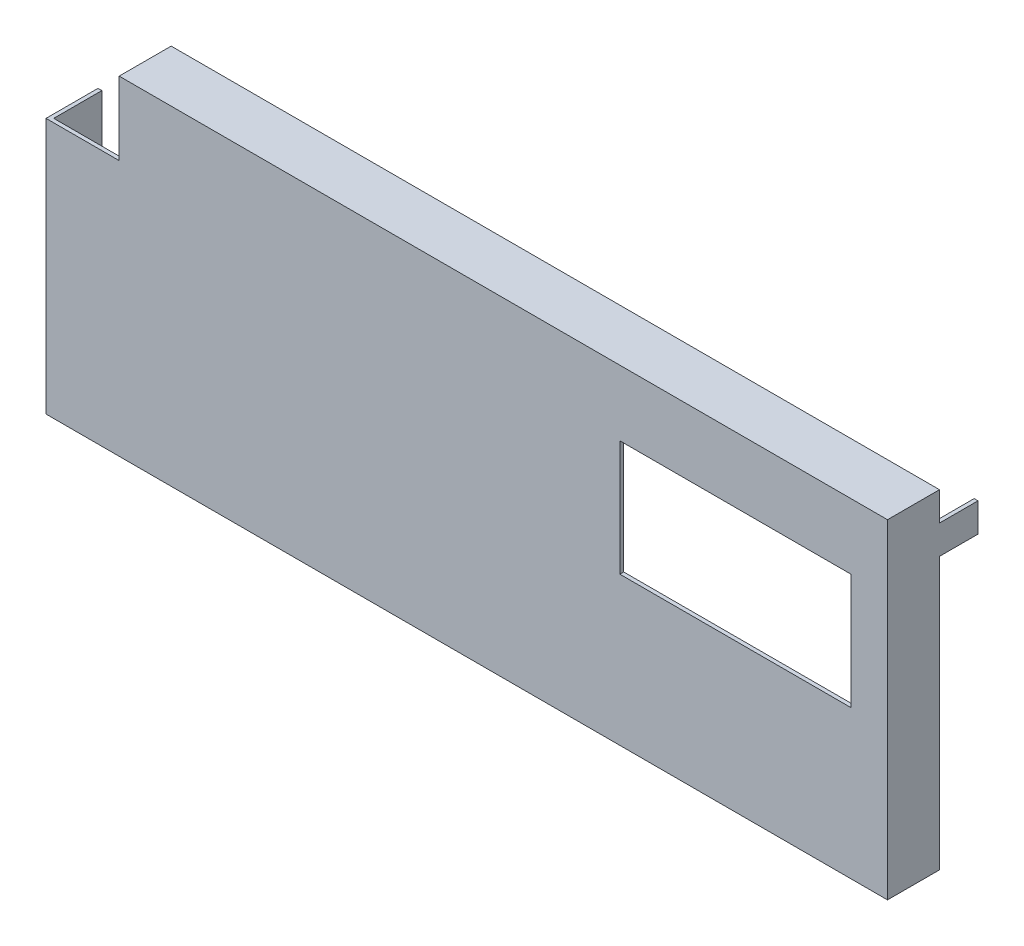
ISO-10303-21;
HEADER;
FILE_DESCRIPTION(('STEP AP214'),'2;1');
FILE_NAME('part.step','',(''),(''),'','','');
FILE_SCHEMA(('AUTOMOTIVE_DESIGN { 1 0 10303 214 1 1 1 1 }'));
ENDSEC;
DATA;
#1=APPLICATION_CONTEXT('core data for automotive mechanical design processes');
#2=APPLICATION_PROTOCOL_DEFINITION('international standard','automotive_design',2000,#1);
#3=PRODUCT_CONTEXT('',#1,'mechanical');
#4=PRODUCT('Part','Part','',(#3));
#5=PRODUCT_RELATED_PRODUCT_CATEGORY('part','',(#4));
#6=PRODUCT_DEFINITION_FORMATION('','',#4);
#7=PRODUCT_DEFINITION_CONTEXT('part definition',#1,'design');
#8=PRODUCT_DEFINITION('design','',#6,#7);
#9=PRODUCT_DEFINITION_SHAPE('','',#8);
#10=(LENGTH_UNIT() NAMED_UNIT(*) SI_UNIT(.MILLI.,.METRE.));
#11=(NAMED_UNIT(*) PLANE_ANGLE_UNIT() SI_UNIT($,.RADIAN.));
#12=(NAMED_UNIT(*) SI_UNIT($,.STERADIAN.) SOLID_ANGLE_UNIT());
#13=UNCERTAINTY_MEASURE_WITH_UNIT(LENGTH_MEASURE(1.E-05),#10,'distance_accuracy_value','');
#14=(GEOMETRIC_REPRESENTATION_CONTEXT(3) GLOBAL_UNCERTAINTY_ASSIGNED_CONTEXT((#13)) GLOBAL_UNIT_ASSIGNED_CONTEXT((#10,
#11,#12)) REPRESENTATION_CONTEXT('',''));
#15=CARTESIAN_POINT('',(0.,0.,0.));
#16=DIRECTION('',(0.,0.,1.));
#17=DIRECTION('',(1.,0.,0.));
#18=AXIS2_PLACEMENT_3D('',#15,#16,#17);
#19=CARTESIAN_POINT('',(-21.85,-8.35,0.));
#20=DIRECTION('',(0.,-1.,0.));
#21=DIRECTION('',(0.,0.,-1.));
#22=AXIS2_PLACEMENT_3D('',#19,#20,#21);
#23=PLANE('',#22);
#24=DIRECTION('',(1.,0.,0.));
#25=VECTOR('',#24,1.);
#26=CARTESIAN_POINT('',(0.,-8.35,2.5));
#27=LINE('',#26,#25);
#28=CARTESIAN_POINT('',(-21.65,-8.35,2.5));
#29=VERTEX_POINT('',#28);
#30=CARTESIAN_POINT('',(21.65,-8.35,2.5));
#31=VERTEX_POINT('',#30);
#32=EDGE_CURVE('E274',#29,#31,#27,.T.);
#33=ORIENTED_EDGE('',*,*,#32,.T.);
#34=DIRECTION('',(0.,0.,-1.));
#35=VECTOR('',#34,1.);
#36=CARTESIAN_POINT('',(21.65,-8.35,0.));
#37=LINE('',#36,#35);
#38=CARTESIAN_POINT('',(21.65,-8.35,0.));
#39=VERTEX_POINT('',#38);
#40=EDGE_CURVE('E19',#31,#39,#37,.T.);
#41=ORIENTED_EDGE('',*,*,#40,.T.);
#42=DIRECTION('',(1.,0.,0.));
#43=VECTOR('',#42,1.);
#44=CARTESIAN_POINT('',(0.,-8.35,0.));
#45=LINE('',#44,#43);
#46=CARTESIAN_POINT('',(-18.85,-8.35,0.));
#47=VERTEX_POINT('',#46);
#48=EDGE_CURVE('E309',#39,#47,#45,.F.);
#49=ORIENTED_EDGE('',*,*,#48,.T.);
#50=DIRECTION('',(0.,0.,-1.));
#51=VECTOR('',#50,1.);
#52=CARTESIAN_POINT('',(-18.85,-8.35,0.));
#53=LINE('',#52,#51);
#54=CARTESIAN_POINT('',(-18.85,-8.35,-2.));
#55=VERTEX_POINT('',#54);
#56=EDGE_CURVE('E317',#55,#47,#53,.F.);
#57=ORIENTED_EDGE('',*,*,#56,.F.);
#58=DIRECTION('',(-1.,0.,0.));
#59=VECTOR('',#58,1.);
#60=CARTESIAN_POINT('',(0.,-8.35,-2.));
#61=LINE('',#60,#59);
#62=CARTESIAN_POINT('',(-20.35,-8.35,-2.));
#63=VERTEX_POINT('',#62);
#64=EDGE_CURVE('E169',#63,#55,#61,.F.);
#65=ORIENTED_EDGE('',*,*,#64,.F.);
#66=DIRECTION('',(0.,0.,1.));
#67=VECTOR('',#66,1.);
#68=CARTESIAN_POINT('',(-20.35,-8.35,0.));
#69=LINE('',#68,#67);
#70=CARTESIAN_POINT('',(-20.35,-8.35,0.));
#71=VERTEX_POINT('',#70);
#72=EDGE_CURVE('E171',#71,#63,#69,.F.);
#73=ORIENTED_EDGE('',*,*,#72,.F.);
#74=DIRECTION('',(1.,0.,0.));
#75=VECTOR('',#74,1.);
#76=CARTESIAN_POINT('',(0.,-8.35,0.));
#77=LINE('',#76,#75);
#78=CARTESIAN_POINT('',(-21.65,-8.35,0.));
#79=VERTEX_POINT('',#78);
#80=EDGE_CURVE('E173',#71,#79,#77,.F.);
#81=ORIENTED_EDGE('',*,*,#80,.T.);
#82=DIRECTION('',(0.,0.,1.));
#83=VECTOR('',#82,1.);
#84=CARTESIAN_POINT('',(-21.65,-8.35,0.));
#85=LINE('',#84,#83);
#86=EDGE_CURVE('E279',#79,#29,#85,.T.);
#87=ORIENTED_EDGE('',*,*,#86,.T.);
#88=EDGE_LOOP('',(#33,#41,#49,#57,#65,#73,#81,#87));
#89=FACE_BOUND('',#88,.T.);
#90=ADVANCED_FACE('F16',(#89),#23,.F.);
#91=CARTESIAN_POINT('',(21.65,-8.55,0.));
#92=DIRECTION('',(1.,0.,0.));
#93=DIRECTION('',(0.,0.,-1.));
#94=AXIS2_PLACEMENT_3D('',#91,#92,#93);
#95=PLANE('',#94);
#96=DIRECTION('',(0.,1.,0.));
#97=VECTOR('',#96,1.);
#98=CARTESIAN_POINT('',(21.65,0.,2.5));
#99=LINE('',#98,#97);
#100=CARTESIAN_POINT('',(21.65,8.35,2.5));
#101=VERTEX_POINT('',#100);
#102=EDGE_CURVE('E272',#31,#101,#99,.T.);
#103=ORIENTED_EDGE('',*,*,#102,.T.);
#104=DIRECTION('',(0.,0.,1.));
#105=VECTOR('',#104,1.);
#106=CARTESIAN_POINT('',(21.65,8.35,0.));
#107=LINE('',#106,#105);
#108=CARTESIAN_POINT('',(21.65,8.35,0.));
#109=VERTEX_POINT('',#108);
#110=EDGE_CURVE('E285',#101,#109,#107,.F.);
#111=ORIENTED_EDGE('',*,*,#110,.T.);
#112=DIRECTION('',(0.,1.,0.));
#113=VECTOR('',#112,1.);
#114=CARTESIAN_POINT('',(21.65,0.,0.));
#115=LINE('',#114,#113);
#116=CARTESIAN_POINT('',(21.65,7.05,0.));
#117=VERTEX_POINT('',#116);
#118=EDGE_CURVE('E287',#109,#117,#115,.F.);
#119=ORIENTED_EDGE('',*,*,#118,.T.);
#120=DIRECTION('',(0.,0.,1.));
#121=VECTOR('',#120,1.);
#122=CARTESIAN_POINT('',(21.65,7.05,0.));
#123=LINE('',#122,#121);
#124=CARTESIAN_POINT('',(21.65,7.05,-2.));
#125=VERTEX_POINT('',#124);
#126=EDGE_CURVE('E294',#125,#117,#123,.T.);
#127=ORIENTED_EDGE('',*,*,#126,.F.);
#128=DIRECTION('',(0.,1.,0.));
#129=VECTOR('',#128,1.);
#130=CARTESIAN_POINT('',(21.65,0.,-2.));
#131=LINE('',#130,#129);
#132=CARTESIAN_POINT('',(21.65,5.55,-2.));
#133=VERTEX_POINT('',#132);
#134=EDGE_CURVE('E299',#133,#125,#131,.T.);
#135=ORIENTED_EDGE('',*,*,#134,.F.);
#136=DIRECTION('',(0.,0.,-1.));
#137=VECTOR('',#136,1.);
#138=CARTESIAN_POINT('',(21.65,5.55,0.));
#139=LINE('',#138,#137);
#140=CARTESIAN_POINT('',(21.65,5.55,0.));
#141=VERTEX_POINT('',#140);
#142=EDGE_CURVE('E307',#141,#133,#139,.T.);
#143=ORIENTED_EDGE('',*,*,#142,.F.);
#144=DIRECTION('',(0.,1.,0.));
#145=VECTOR('',#144,1.);
#146=CARTESIAN_POINT('',(21.65,0.,0.));
#147=LINE('',#146,#145);
#148=EDGE_CURVE('E312',#141,#39,#147,.F.);
#149=ORIENTED_EDGE('',*,*,#148,.T.);
#150=ORIENTED_EDGE('',*,*,#40,.F.);
#151=EDGE_LOOP('',(#103,#111,#119,#127,#135,#143,#149,#150));
#152=FACE_BOUND('',#151,.T.);
#153=ADVANCED_FACE('F403',(#152),#95,.F.);
#154=CARTESIAN_POINT('',(0.,0.,0.));
#155=DIRECTION('',(0.,0.,1.));
#156=DIRECTION('',(1.,0.,0.));
#157=AXIS2_PLACEMENT_3D('',#154,#155,#156);
#158=PLANE('',#157);
#159=DIRECTION('',(0.,1.,0.));
#160=VECTOR('',#159,1.);
#161=CARTESIAN_POINT('',(-21.85,8.55,0.));
#162=LINE('',#161,#160);
#163=CARTESIAN_POINT('',(-21.85,4.75,0.));
#164=VERTEX_POINT('',#163);
#165=CARTESIAN_POINT('',(-21.85,-8.55,0.));
#166=VERTEX_POINT('',#165);
#167=EDGE_CURVE('E210',#164,#166,#162,.F.);
#168=ORIENTED_EDGE('',*,*,#167,.F.);
#169=DIRECTION('',(1.,0.,0.));
#170=VECTOR('',#169,1.);
#171=CARTESIAN_POINT('',(0.,4.75,0.));
#172=LINE('',#171,#170);
#173=CARTESIAN_POINT('',(-21.65,4.75,0.));
#174=VERTEX_POINT('',#173);
#175=EDGE_CURVE('E189',#174,#164,#172,.F.);
#176=ORIENTED_EDGE('',*,*,#175,.F.);
#177=DIRECTION('',(0.,1.,0.));
#178=VECTOR('',#177,1.);
#179=CARTESIAN_POINT('',(-21.65,8.55,0.));
#180=LINE('',#179,#178);
#181=EDGE_CURVE('E187',#174,#79,#180,.F.);
#182=ORIENTED_EDGE('',*,*,#181,.T.);
#183=ORIENTED_EDGE('',*,*,#80,.F.);
#184=DIRECTION('',(0.,1.,0.));
#185=VECTOR('',#184,1.);
#186=CARTESIAN_POINT('',(-20.35,-8.55,0.));
#187=LINE('',#186,#185);
#188=CARTESIAN_POINT('',(-20.35,-8.55,0.));
#189=VERTEX_POINT('',#188);
#190=EDGE_CURVE('E178',#189,#71,#187,.T.);
#191=ORIENTED_EDGE('',*,*,#190,.F.);
#192=DIRECTION('',(1.,0.,0.));
#193=VECTOR('',#192,1.);
#194=CARTESIAN_POINT('',(0.,-8.55,0.));
#195=LINE('',#194,#193);
#196=EDGE_CURVE('E179',#166,#189,#195,.T.);
#197=ORIENTED_EDGE('',*,*,#196,.F.);
#198=EDGE_LOOP('',(#168,#176,#182,#183,#191,#197));
#199=FACE_BOUND('',#198,.T.);
#200=ADVANCED_FACE('F184',(#199),#158,.F.);
#201=CARTESIAN_POINT('',(-20.35,-8.55,0.));
#202=DIRECTION('',(-1.,0.,0.));
#203=DIRECTION('',(0.,0.,1.));
#204=AXIS2_PLACEMENT_3D('',#201,#202,#203);
#205=PLANE('',#204);
#206=DIRECTION('',(0.,0.,-1.));
#207=VECTOR('',#206,1.);
#208=CARTESIAN_POINT('',(-20.35,-8.55,0.));
#209=LINE('',#208,#207);
#210=CARTESIAN_POINT('',(-20.35,-8.55,-2.));
#211=VERTEX_POINT('',#210);
#212=EDGE_CURVE('E192',#189,#211,#209,.T.);
#213=ORIENTED_EDGE('',*,*,#212,.F.);
#214=ORIENTED_EDGE('',*,*,#190,.T.);
#215=ORIENTED_EDGE('',*,*,#72,.T.);
#216=DIRECTION('',(0.,1.,0.));
#217=VECTOR('',#216,1.);
#218=CARTESIAN_POINT('',(-20.35,0.,-2.));
#219=LINE('',#218,#217);
#220=EDGE_CURVE('E194',#211,#63,#219,.T.);
#221=ORIENTED_EDGE('',*,*,#220,.F.);
#222=EDGE_LOOP('',(#213,#214,#215,#221));
#223=FACE_BOUND('',#222,.T.);
#224=ADVANCED_FACE('F190',(#223),#205,.T.);
#225=CARTESIAN_POINT('',(0.,0.,-2.));
#226=DIRECTION('',(0.,0.,-1.));
#227=DIRECTION('',(-1.,0.,0.));
#228=AXIS2_PLACEMENT_3D('',#225,#226,#227);
#229=PLANE('',#228);
#230=DIRECTION('',(1.,0.,0.));
#231=VECTOR('',#230,1.);
#232=CARTESIAN_POINT('',(-21.85,-8.55,-2.));
#233=LINE('',#232,#231);
#234=CARTESIAN_POINT('',(-18.85,-8.55,-2.));
#235=VERTEX_POINT('',#234);
#236=EDGE_CURVE('E266',#211,#235,#233,.T.);
#237=ORIENTED_EDGE('',*,*,#236,.F.);
#238=ORIENTED_EDGE('',*,*,#220,.T.);
#239=ORIENTED_EDGE('',*,*,#64,.T.);
#240=DIRECTION('',(0.,1.,0.));
#241=VECTOR('',#240,1.);
#242=CARTESIAN_POINT('',(-18.85,-8.35,-2.));
#243=LINE('',#242,#241);
#244=EDGE_CURVE('E319',#235,#55,#243,.T.);
#245=ORIENTED_EDGE('',*,*,#244,.F.);
#246=EDGE_LOOP('',(#237,#238,#239,#245));
#247=FACE_BOUND('',#246,.T.);
#248=ADVANCED_FACE('F323',(#247),#229,.T.);
#249=CARTESIAN_POINT('',(-18.85,-8.35,0.));
#250=DIRECTION('',(1.,0.,0.));
#251=DIRECTION('',(0.,0.,-1.));
#252=AXIS2_PLACEMENT_3D('',#249,#250,#251);
#253=PLANE('',#252);
#254=ORIENTED_EDGE('',*,*,#56,.T.);
#255=DIRECTION('',(0.,1.,0.));
#256=VECTOR('',#255,1.);
#257=CARTESIAN_POINT('',(-18.85,0.,0.));
#258=LINE('',#257,#256);
#259=CARTESIAN_POINT('',(-18.85,-8.55,0.));
#260=VERTEX_POINT('',#259);
#261=EDGE_CURVE('E315',#47,#260,#258,.F.);
#262=ORIENTED_EDGE('',*,*,#261,.T.);
#263=DIRECTION('',(0.,0.,-1.));
#264=VECTOR('',#263,1.);
#265=CARTESIAN_POINT('',(-18.85,-8.55,0.));
#266=LINE('',#265,#264);
#267=EDGE_CURVE('E263',#235,#260,#266,.F.);
#268=ORIENTED_EDGE('',*,*,#267,.F.);
#269=ORIENTED_EDGE('',*,*,#244,.T.);
#270=EDGE_LOOP('',(#254,#262,#268,#269));
#271=FACE_BOUND('',#270,.T.);
#272=ADVANCED_FACE('F431',(#271),#253,.T.);
#273=CARTESIAN_POINT('',(0.,0.,0.));
#274=DIRECTION('',(0.,0.,1.));
#275=DIRECTION('',(1.,0.,0.));
#276=AXIS2_PLACEMENT_3D('',#273,#274,#275);
#277=PLANE('',#276);
#278=ORIENTED_EDGE('',*,*,#148,.F.);
#279=DIRECTION('',(1.,0.,0.));
#280=VECTOR('',#279,1.);
#281=CARTESIAN_POINT('',(21.85,5.55,0.));
#282=LINE('',#281,#280);
#283=CARTESIAN_POINT('',(21.85,5.55,0.));
#284=VERTEX_POINT('',#283);
#285=EDGE_CURVE('E304',#284,#141,#282,.F.);
#286=ORIENTED_EDGE('',*,*,#285,.F.);
#287=DIRECTION('',(0.,1.,0.));
#288=VECTOR('',#287,1.);
#289=CARTESIAN_POINT('',(21.85,-8.55,0.));
#290=LINE('',#289,#288);
#291=CARTESIAN_POINT('',(21.85,-8.55,0.));
#292=VERTEX_POINT('',#291);
#293=EDGE_CURVE('E255',#292,#284,#290,.T.);
#294=ORIENTED_EDGE('',*,*,#293,.F.);
#295=DIRECTION('',(1.,0.,0.));
#296=VECTOR('',#295,1.);
#297=CARTESIAN_POINT('',(-21.85,-8.55,0.));
#298=LINE('',#297,#296);
#299=EDGE_CURVE('E261',#260,#292,#298,.T.);
#300=ORIENTED_EDGE('',*,*,#299,.F.);
#301=ORIENTED_EDGE('',*,*,#261,.F.);
#302=ORIENTED_EDGE('',*,*,#48,.F.);
#303=EDGE_LOOP('',(#278,#286,#294,#300,#301,#302));
#304=FACE_BOUND('',#303,.T.);
#305=ADVANCED_FACE('F427',(#304),#277,.F.);
#306=CARTESIAN_POINT('',(21.85,5.55,0.));
#307=DIRECTION('',(0.,-1.,0.));
#308=DIRECTION('',(0.,0.,-1.));
#309=AXIS2_PLACEMENT_3D('',#306,#307,#308);
#310=PLANE('',#309);
#311=DIRECTION('',(0.,0.,-1.));
#312=VECTOR('',#311,1.);
#313=CARTESIAN_POINT('',(21.85,5.55,0.));
#314=LINE('',#313,#312);
#315=CARTESIAN_POINT('',(21.85,5.55,-2.));
#316=VERTEX_POINT('',#315);
#317=EDGE_CURVE('E252',#284,#316,#314,.T.);
#318=ORIENTED_EDGE('',*,*,#317,.F.);
#319=ORIENTED_EDGE('',*,*,#285,.T.);
#320=ORIENTED_EDGE('',*,*,#142,.T.);
#321=DIRECTION('',(-1.,0.,0.));
#322=VECTOR('',#321,1.);
#323=CARTESIAN_POINT('',(0.,5.55,-2.));
#324=LINE('',#323,#322);
#325=EDGE_CURVE('E301',#316,#133,#324,.T.);
#326=ORIENTED_EDGE('',*,*,#325,.F.);
#327=EDGE_LOOP('',(#318,#319,#320,#326));
#328=FACE_BOUND('',#327,.T.);
#329=ADVANCED_FACE('F424',(#328),#310,.T.);
#330=CARTESIAN_POINT('',(0.,0.,-2.));
#331=DIRECTION('',(0.,0.,-1.));
#332=DIRECTION('',(-1.,0.,0.));
#333=AXIS2_PLACEMENT_3D('',#330,#331,#332);
#334=PLANE('',#333);
#335=ORIENTED_EDGE('',*,*,#325,.T.);
#336=ORIENTED_EDGE('',*,*,#134,.T.);
#337=DIRECTION('',(1.,0.,0.));
#338=VECTOR('',#337,1.);
#339=CARTESIAN_POINT('',(21.65,7.05,-2.));
#340=LINE('',#339,#338);
#341=CARTESIAN_POINT('',(21.85,7.05,-2.));
#342=VERTEX_POINT('',#341);
#343=EDGE_CURVE('E296',#342,#125,#340,.F.);
#344=ORIENTED_EDGE('',*,*,#343,.F.);
#345=DIRECTION('',(0.,1.,0.));
#346=VECTOR('',#345,1.);
#347=CARTESIAN_POINT('',(21.85,-8.55,-2.));
#348=LINE('',#347,#346);
#349=EDGE_CURVE('E249',#316,#342,#348,.T.);
#350=ORIENTED_EDGE('',*,*,#349,.F.);
#351=EDGE_LOOP('',(#335,#336,#344,#350));
#352=FACE_BOUND('',#351,.T.);
#353=ADVANCED_FACE('F421',(#352),#334,.T.);
#354=CARTESIAN_POINT('',(21.65,7.05,0.));
#355=DIRECTION('',(0.,1.,0.));
#356=DIRECTION('',(0.,0.,1.));
#357=AXIS2_PLACEMENT_3D('',#354,#355,#356);
#358=PLANE('',#357);
#359=ORIENTED_EDGE('',*,*,#126,.T.);
#360=DIRECTION('',(1.,0.,0.));
#361=VECTOR('',#360,1.);
#362=CARTESIAN_POINT('',(0.,7.05,0.));
#363=LINE('',#362,#361);
#364=CARTESIAN_POINT('',(21.85,7.05,0.));
#365=VERTEX_POINT('',#364);
#366=EDGE_CURVE('E292',#117,#365,#363,.T.);
#367=ORIENTED_EDGE('',*,*,#366,.T.);
#368=DIRECTION('',(0.,0.,-1.));
#369=VECTOR('',#368,1.);
#370=CARTESIAN_POINT('',(21.85,7.05,0.));
#371=LINE('',#370,#369);
#372=EDGE_CURVE('E246',#342,#365,#371,.F.);
#373=ORIENTED_EDGE('',*,*,#372,.F.);
#374=ORIENTED_EDGE('',*,*,#343,.T.);
#375=EDGE_LOOP('',(#359,#367,#373,#374));
#376=FACE_BOUND('',#375,.T.);
#377=ADVANCED_FACE('F417',(#376),#358,.T.);
#378=CARTESIAN_POINT('',(0.,0.,0.));
#379=DIRECTION('',(0.,0.,1.));
#380=DIRECTION('',(1.,0.,0.));
#381=AXIS2_PLACEMENT_3D('',#378,#379,#380);
#382=PLANE('',#381);
#383=DIRECTION('',(1.,0.,0.));
#384=VECTOR('',#383,1.);
#385=CARTESIAN_POINT('',(21.85,8.35,0.));
#386=LINE('',#385,#384);
#387=CARTESIAN_POINT('',(-18.05,8.35,0.));
#388=VERTEX_POINT('',#387);
#389=EDGE_CURVE('E282',#109,#388,#386,.F.);
#390=ORIENTED_EDGE('',*,*,#389,.T.);
#391=DIRECTION('',(0.,1.,0.));
#392=VECTOR('',#391,1.);
#393=CARTESIAN_POINT('',(-18.05,0.,0.));
#394=LINE('',#393,#392);
#395=CARTESIAN_POINT('',(-18.05,8.55,0.));
#396=VERTEX_POINT('',#395);
#397=EDGE_CURVE('E290',#396,#388,#394,.F.);
#398=ORIENTED_EDGE('',*,*,#397,.F.);
#399=DIRECTION('',(1.,0.,0.));
#400=VECTOR('',#399,1.);
#401=CARTESIAN_POINT('',(21.85,8.55,0.));
#402=LINE('',#401,#400);
#403=CARTESIAN_POINT('',(21.85,8.55,0.));
#404=VERTEX_POINT('',#403);
#405=EDGE_CURVE('E238',#404,#396,#402,.F.);
#406=ORIENTED_EDGE('',*,*,#405,.F.);
#407=DIRECTION('',(0.,1.,0.));
#408=VECTOR('',#407,1.);
#409=CARTESIAN_POINT('',(21.85,-8.55,0.));
#410=LINE('',#409,#408);
#411=EDGE_CURVE('E244',#365,#404,#410,.T.);
#412=ORIENTED_EDGE('',*,*,#411,.F.);
#413=ORIENTED_EDGE('',*,*,#366,.F.);
#414=ORIENTED_EDGE('',*,*,#118,.F.);
#415=EDGE_LOOP('',(#390,#398,#406,#412,#413,#414));
#416=FACE_BOUND('',#415,.T.);
#417=ADVANCED_FACE('F414',(#416),#382,.F.);
#418=CARTESIAN_POINT('',(21.85,8.35,0.));
#419=DIRECTION('',(0.,1.,0.));
#420=DIRECTION('',(0.,0.,1.));
#421=AXIS2_PLACEMENT_3D('',#418,#419,#420);
#422=PLANE('',#421);
#423=ORIENTED_EDGE('',*,*,#110,.F.);
#424=DIRECTION('',(1.,0.,0.));
#425=VECTOR('',#424,1.);
#426=CARTESIAN_POINT('',(0.,8.35,2.5));
#427=LINE('',#426,#425);
#428=CARTESIAN_POINT('',(-18.05,8.35,2.5));
#429=VERTEX_POINT('',#428);
#430=EDGE_CURVE('E214',#101,#429,#427,.F.);
#431=ORIENTED_EDGE('',*,*,#430,.T.);
#432=DIRECTION('',(0.,0.,-1.));
#433=VECTOR('',#432,1.);
#434=CARTESIAN_POINT('',(-18.05,8.35,2.7));
#435=LINE('',#434,#433);
#436=EDGE_CURVE('E230',#429,#388,#435,.T.);
#437=ORIENTED_EDGE('',*,*,#436,.T.);
#438=ORIENTED_EDGE('',*,*,#389,.F.);
#439=EDGE_LOOP('',(#423,#431,#437,#438));
#440=FACE_BOUND('',#439,.T.);
#441=ADVANCED_FACE('F408',(#440),#422,.F.);
#442=CARTESIAN_POINT('',(-21.65,8.55,0.));
#443=DIRECTION('',(-1.,0.,0.));
#444=DIRECTION('',(0.,0.,1.));
#445=AXIS2_PLACEMENT_3D('',#442,#443,#444);
#446=PLANE('',#445);
#447=ORIENTED_EDGE('',*,*,#86,.F.);
#448=ORIENTED_EDGE('',*,*,#181,.F.);
#449=DIRECTION('',(0.,0.,-1.));
#450=VECTOR('',#449,1.);
#451=CARTESIAN_POINT('',(-21.65,4.75,2.7));
#452=LINE('',#451,#450);
#453=CARTESIAN_POINT('',(-21.65,4.75,2.5));
#454=VERTEX_POINT('',#453);
#455=EDGE_CURVE('E208',#174,#454,#452,.F.);
#456=ORIENTED_EDGE('',*,*,#455,.T.);
#457=DIRECTION('',(0.,1.,0.));
#458=VECTOR('',#457,1.);
#459=CARTESIAN_POINT('',(-21.65,0.,2.5));
#460=LINE('',#459,#458);
#461=EDGE_CURVE('E276',#454,#29,#460,.F.);
#462=ORIENTED_EDGE('',*,*,#461,.T.);
#463=EDGE_LOOP('',(#447,#448,#456,#462));
#464=FACE_BOUND('',#463,.T.);
#465=ADVANCED_FACE('F400',(#464),#446,.F.);
#466=CARTESIAN_POINT('',(0.,0.,2.5));
#467=DIRECTION('',(0.,0.,1.));
#468=DIRECTION('',(1.,0.,0.));
#469=AXIS2_PLACEMENT_3D('',#466,#467,#468);
#470=PLANE('',#469);
#471=DIRECTION('',(0.,1.,0.));
#472=VECTOR('',#471,1.);
#473=CARTESIAN_POINT('',(19.95,-0.85,2.5));
#474=LINE('',#473,#472);
#475=CARTESIAN_POINT('',(19.95,-0.85,2.5));
#476=VERTEX_POINT('',#475);
#477=CARTESIAN_POINT('',(19.95,5.15,2.5));
#478=VERTEX_POINT('',#477);
#479=EDGE_CURVE('E222',#476,#478,#474,.T.);
#480=ORIENTED_EDGE('',*,*,#479,.T.);
#481=DIRECTION('',(1.,0.,0.));
#482=VECTOR('',#481,1.);
#483=CARTESIAN_POINT('',(19.95,5.15,2.5));
#484=LINE('',#483,#482);
#485=CARTESIAN_POINT('',(7.95,5.15,2.5));
#486=VERTEX_POINT('',#485);
#487=EDGE_CURVE('E219',#478,#486,#484,.F.);
#488=ORIENTED_EDGE('',*,*,#487,.T.);
#489=DIRECTION('',(0.,1.,0.));
#490=VECTOR('',#489,1.);
#491=CARTESIAN_POINT('',(7.95,5.15,2.5));
#492=LINE('',#491,#490);
#493=CARTESIAN_POINT('',(7.95,-0.85,2.5));
#494=VERTEX_POINT('',#493);
#495=EDGE_CURVE('E339',#486,#494,#492,.F.);
#496=ORIENTED_EDGE('',*,*,#495,.T.);
#497=DIRECTION('',(1.,0.,0.));
#498=VECTOR('',#497,1.);
#499=CARTESIAN_POINT('',(7.95,-0.85,2.5));
#500=LINE('',#499,#498);
#501=EDGE_CURVE('E349',#494,#476,#500,.T.);
#502=ORIENTED_EDGE('',*,*,#501,.T.);
#503=EDGE_LOOP('',(#480,#488,#496,#502));
#504=FACE_BOUND('',#503,.T.);
#505=ORIENTED_EDGE('',*,*,#430,.F.);
#506=ORIENTED_EDGE('',*,*,#102,.F.);
#507=ORIENTED_EDGE('',*,*,#32,.F.);
#508=ORIENTED_EDGE('',*,*,#461,.F.);
#509=DIRECTION('',(1.,0.,0.));
#510=VECTOR('',#509,1.);
#511=CARTESIAN_POINT('',(-23.05,4.75,2.5));
#512=LINE('',#511,#510);
#513=CARTESIAN_POINT('',(-18.05,4.75,2.5));
#514=VERTEX_POINT('',#513);
#515=EDGE_CURVE('E224',#454,#514,#512,.T.);
#516=ORIENTED_EDGE('',*,*,#515,.T.);
#517=DIRECTION('',(0.,1.,0.));
#518=VECTOR('',#517,1.);
#519=CARTESIAN_POINT('',(-18.05,4.75,2.5));
#520=LINE('',#519,#518);
#521=EDGE_CURVE('E233',#514,#429,#520,.T.);
#522=ORIENTED_EDGE('',*,*,#521,.T.);
#523=EDGE_LOOP('',(#505,#506,#507,#508,#516,#522));
#524=FACE_BOUND('',#523,.T.);
#525=ADVANCED_FACE('F355',(#504,#524),#470,.F.);
#526=CARTESIAN_POINT('',(-21.85,8.55,0.));
#527=DIRECTION('',(-1.,0.,0.));
#528=DIRECTION('',(0.,0.,1.));
#529=AXIS2_PLACEMENT_3D('',#526,#527,#528);
#530=PLANE('',#529);
#531=DIRECTION('',(0.,1.,0.));
#532=VECTOR('',#531,1.);
#533=CARTESIAN_POINT('',(-21.85,0.,2.7));
#534=LINE('',#533,#532);
#535=CARTESIAN_POINT('',(-21.85,4.75,2.7));
#536=VERTEX_POINT('',#535);
#537=CARTESIAN_POINT('',(-21.85,-8.55,2.7));
#538=VERTEX_POINT('',#537);
#539=EDGE_CURVE('E218',#536,#538,#534,.F.);
#540=ORIENTED_EDGE('',*,*,#539,.F.);
#541=DIRECTION('',(0.,0.,-1.));
#542=VECTOR('',#541,1.);
#543=CARTESIAN_POINT('',(-21.85,4.75,2.7));
#544=LINE('',#543,#542);
#545=EDGE_CURVE('E205',#536,#164,#544,.T.);
#546=ORIENTED_EDGE('',*,*,#545,.T.);
#547=ORIENTED_EDGE('',*,*,#167,.T.);
#548=DIRECTION('',(0.,0.,-1.));
#549=VECTOR('',#548,1.);
#550=CARTESIAN_POINT('',(-21.85,-8.55,0.));
#551=LINE('',#550,#549);
#552=EDGE_CURVE('E213',#538,#166,#551,.T.);
#553=ORIENTED_EDGE('',*,*,#552,.F.);
#554=EDGE_LOOP('',(#540,#546,#547,#553));
#555=FACE_BOUND('',#554,.T.);
#556=ADVANCED_FACE('F216',(#555),#530,.T.);
#557=CARTESIAN_POINT('',(-21.85,-8.55,0.));
#558=DIRECTION('',(0.,-1.,0.));
#559=DIRECTION('',(0.,0.,-1.));
#560=AXIS2_PLACEMENT_3D('',#557,#558,#559);
#561=PLANE('',#560);
#562=ORIENTED_EDGE('',*,*,#267,.T.);
#563=ORIENTED_EDGE('',*,*,#299,.T.);
#564=DIRECTION('',(0.,0.,-1.));
#565=VECTOR('',#564,1.);
#566=CARTESIAN_POINT('',(21.85,-8.55,0.));
#567=LINE('',#566,#565);
#568=CARTESIAN_POINT('',(21.85,-8.55,2.7));
#569=VERTEX_POINT('',#568);
#570=EDGE_CURVE('E258',#569,#292,#567,.T.);
#571=ORIENTED_EDGE('',*,*,#570,.F.);
#572=DIRECTION('',(1.,0.,0.));
#573=VECTOR('',#572,1.);
#574=CARTESIAN_POINT('',(0.,-8.55,2.7));
#575=LINE('',#574,#573);
#576=EDGE_CURVE('E329',#538,#569,#575,.T.);
#577=ORIENTED_EDGE('',*,*,#576,.F.);
#578=ORIENTED_EDGE('',*,*,#552,.T.);
#579=ORIENTED_EDGE('',*,*,#196,.T.);
#580=ORIENTED_EDGE('',*,*,#212,.T.);
#581=ORIENTED_EDGE('',*,*,#236,.T.);
#582=EDGE_LOOP('',(#562,#563,#571,#577,#578,#579,#580,#581));
#583=FACE_BOUND('',#582,.T.);
#584=ADVANCED_FACE('F326',(#583),#561,.T.);
#585=CARTESIAN_POINT('',(21.85,-8.55,0.));
#586=DIRECTION('',(1.,0.,0.));
#587=DIRECTION('',(0.,0.,-1.));
#588=AXIS2_PLACEMENT_3D('',#585,#586,#587);
#589=PLANE('',#588);
#590=ORIENTED_EDGE('',*,*,#372,.T.);
#591=ORIENTED_EDGE('',*,*,#411,.T.);
#592=DIRECTION('',(0.,0.,1.));
#593=VECTOR('',#592,1.);
#594=CARTESIAN_POINT('',(21.85,8.55,0.));
#595=LINE('',#594,#593);
#596=CARTESIAN_POINT('',(21.85,8.55,2.7));
#597=VERTEX_POINT('',#596);
#598=EDGE_CURVE('E241',#597,#404,#595,.F.);
#599=ORIENTED_EDGE('',*,*,#598,.F.);
#600=DIRECTION('',(0.,1.,0.));
#601=VECTOR('',#600,1.);
#602=CARTESIAN_POINT('',(21.85,0.,2.7));
#603=LINE('',#602,#601);
#604=EDGE_CURVE('E333',#569,#597,#603,.T.);
#605=ORIENTED_EDGE('',*,*,#604,.F.);
#606=ORIENTED_EDGE('',*,*,#570,.T.);
#607=ORIENTED_EDGE('',*,*,#293,.T.);
#608=ORIENTED_EDGE('',*,*,#317,.T.);
#609=ORIENTED_EDGE('',*,*,#349,.T.);
#610=EDGE_LOOP('',(#590,#591,#599,#605,#606,#607,#608,#609));
#611=FACE_BOUND('',#610,.T.);
#612=ADVANCED_FACE('F383',(#611),#589,.T.);
#613=CARTESIAN_POINT('',(21.85,8.55,0.));
#614=DIRECTION('',(0.,1.,0.));
#615=DIRECTION('',(0.,0.,1.));
#616=AXIS2_PLACEMENT_3D('',#613,#614,#615);
#617=PLANE('',#616);
#618=ORIENTED_EDGE('',*,*,#405,.T.);
#619=DIRECTION('',(0.,0.,-1.));
#620=VECTOR('',#619,1.);
#621=CARTESIAN_POINT('',(-18.05,8.55,2.7));
#622=LINE('',#621,#620);
#623=CARTESIAN_POINT('',(-18.05,8.55,2.7));
#624=VERTEX_POINT('',#623);
#625=EDGE_CURVE('E236',#396,#624,#622,.F.);
#626=ORIENTED_EDGE('',*,*,#625,.T.);
#627=DIRECTION('',(1.,0.,0.));
#628=VECTOR('',#627,1.);
#629=CARTESIAN_POINT('',(0.,8.55,2.7));
#630=LINE('',#629,#628);
#631=EDGE_CURVE('E379',#597,#624,#630,.F.);
#632=ORIENTED_EDGE('',*,*,#631,.F.);
#633=ORIENTED_EDGE('',*,*,#598,.T.);
#634=EDGE_LOOP('',(#618,#626,#632,#633));
#635=FACE_BOUND('',#634,.T.);
#636=ADVANCED_FACE('F387',(#635),#617,.T.);
#637=CARTESIAN_POINT('',(-18.05,4.75,2.7));
#638=DIRECTION('',(1.,0.,0.));
#639=DIRECTION('',(0.,0.,-1.));
#640=AXIS2_PLACEMENT_3D('',#637,#638,#639);
#641=PLANE('',#640);
#642=ORIENTED_EDGE('',*,*,#521,.F.);
#643=DIRECTION('',(0.,0.,-1.));
#644=VECTOR('',#643,1.);
#645=CARTESIAN_POINT('',(-18.05,4.75,2.7));
#646=LINE('',#645,#644);
#647=CARTESIAN_POINT('',(-18.05,4.75,2.7));
#648=VERTEX_POINT('',#647);
#649=EDGE_CURVE('E220',#514,#648,#646,.F.);
#650=ORIENTED_EDGE('',*,*,#649,.T.);
#651=DIRECTION('',(0.,1.,0.));
#652=VECTOR('',#651,1.);
#653=CARTESIAN_POINT('',(-18.05,0.,2.7));
#654=LINE('',#653,#652);
#655=EDGE_CURVE('E374',#624,#648,#654,.F.);
#656=ORIENTED_EDGE('',*,*,#655,.F.);
#657=ORIENTED_EDGE('',*,*,#625,.F.);
#658=ORIENTED_EDGE('',*,*,#397,.T.);
#659=ORIENTED_EDGE('',*,*,#436,.F.);
#660=EDGE_LOOP('',(#642,#650,#656,#657,#658,#659));
#661=FACE_BOUND('',#660,.T.);
#662=ADVANCED_FACE('F392',(#661),#641,.F.);
#663=CARTESIAN_POINT('',(-23.05,4.75,2.7));
#664=DIRECTION('',(0.,-1.,0.));
#665=DIRECTION('',(0.,0.,-1.));
#666=AXIS2_PLACEMENT_3D('',#663,#664,#665);
#667=PLANE('',#666);
#668=DIRECTION('',(1.,0.,0.));
#669=VECTOR('',#668,1.);
#670=CARTESIAN_POINT('',(0.,4.75,2.7));
#671=LINE('',#670,#669);
#672=EDGE_CURVE('E337',#648,#536,#671,.F.);
#673=ORIENTED_EDGE('',*,*,#672,.F.);
#674=ORIENTED_EDGE('',*,*,#649,.F.);
#675=ORIENTED_EDGE('',*,*,#515,.F.);
#676=ORIENTED_EDGE('',*,*,#455,.F.);
#677=ORIENTED_EDGE('',*,*,#175,.T.);
#678=ORIENTED_EDGE('',*,*,#545,.F.);
#679=EDGE_LOOP('',(#673,#674,#675,#676,#677,#678));
#680=FACE_BOUND('',#679,.T.);
#681=ADVANCED_FACE('F203',(#680),#667,.F.);
#682=CARTESIAN_POINT('',(19.95,5.15,2.7));
#683=DIRECTION('',(0.,1.,0.));
#684=DIRECTION('',(0.,0.,1.));
#685=AXIS2_PLACEMENT_3D('',#682,#683,#684);
#686=PLANE('',#685);
#687=ORIENTED_EDGE('',*,*,#487,.F.);
#688=DIRECTION('',(0.,0.,-1.));
#689=VECTOR('',#688,1.);
#690=CARTESIAN_POINT('',(19.95,5.15,2.7));
#691=LINE('',#690,#689);
#692=CARTESIAN_POINT('',(19.95,5.15,2.7));
#693=VERTEX_POINT('',#692);
#694=EDGE_CURVE('E351',#478,#693,#691,.F.);
#695=ORIENTED_EDGE('',*,*,#694,.T.);
#696=DIRECTION('',(1.,0.,0.));
#697=VECTOR('',#696,1.);
#698=CARTESIAN_POINT('',(0.,5.15,2.7));
#699=LINE('',#698,#697);
#700=CARTESIAN_POINT('',(7.95,5.15,2.7));
#701=VERTEX_POINT('',#700);
#702=EDGE_CURVE('E371',#701,#693,#699,.T.);
#703=ORIENTED_EDGE('',*,*,#702,.F.);
#704=DIRECTION('',(0.,0.,1.));
#705=VECTOR('',#704,1.);
#706=CARTESIAN_POINT('',(7.95,5.15,2.7));
#707=LINE('',#706,#705);
#708=EDGE_CURVE('E344',#701,#486,#707,.F.);
#709=ORIENTED_EDGE('',*,*,#708,.T.);
#710=EDGE_LOOP('',(#687,#695,#703,#709));
#711=FACE_BOUND('',#710,.T.);
#712=ADVANCED_FACE('F361',(#711),#686,.F.);
#713=CARTESIAN_POINT('',(19.95,-0.85,2.7));
#714=DIRECTION('',(1.,0.,0.));
#715=DIRECTION('',(0.,0.,-1.));
#716=AXIS2_PLACEMENT_3D('',#713,#714,#715);
#717=PLANE('',#716);
#718=ORIENTED_EDGE('',*,*,#479,.F.);
#719=DIRECTION('',(0.,0.,-1.));
#720=VECTOR('',#719,1.);
#721=CARTESIAN_POINT('',(19.95,-0.85,2.7));
#722=LINE('',#721,#720);
#723=CARTESIAN_POINT('',(19.95,-0.85,2.7));
#724=VERTEX_POINT('',#723);
#725=EDGE_CURVE('E347',#476,#724,#722,.F.);
#726=ORIENTED_EDGE('',*,*,#725,.T.);
#727=DIRECTION('',(0.,1.,0.));
#728=VECTOR('',#727,1.);
#729=CARTESIAN_POINT('',(19.95,0.,2.7));
#730=LINE('',#729,#728);
#731=EDGE_CURVE('E367',#693,#724,#730,.F.);
#732=ORIENTED_EDGE('',*,*,#731,.F.);
#733=ORIENTED_EDGE('',*,*,#694,.F.);
#734=EDGE_LOOP('',(#718,#726,#732,#733));
#735=FACE_BOUND('',#734,.T.);
#736=ADVANCED_FACE('F365',(#735),#717,.F.);
#737=CARTESIAN_POINT('',(7.95,-0.85,2.7));
#738=DIRECTION('',(0.,-1.,0.));
#739=DIRECTION('',(0.,0.,-1.));
#740=AXIS2_PLACEMENT_3D('',#737,#738,#739);
#741=PLANE('',#740);
#742=ORIENTED_EDGE('',*,*,#501,.F.);
#743=DIRECTION('',(0.,0.,1.));
#744=VECTOR('',#743,1.);
#745=CARTESIAN_POINT('',(7.95,-0.85,2.7));
#746=LINE('',#745,#744);
#747=CARTESIAN_POINT('',(7.95,-0.85,2.7));
#748=VERTEX_POINT('',#747);
#749=EDGE_CURVE('E34',#494,#748,#746,.T.);
#750=ORIENTED_EDGE('',*,*,#749,.T.);
#751=DIRECTION('',(1.,0.,0.));
#752=VECTOR('',#751,1.);
#753=CARTESIAN_POINT('',(0.,-0.85,2.7));
#754=LINE('',#753,#752);
#755=EDGE_CURVE('E25',#724,#748,#754,.F.);
#756=ORIENTED_EDGE('',*,*,#755,.F.);
#757=ORIENTED_EDGE('',*,*,#725,.F.);
#758=EDGE_LOOP('',(#742,#750,#756,#757));
#759=FACE_BOUND('',#758,.T.);
#760=ADVANCED_FACE('F447',(#759),#741,.F.);
#761=CARTESIAN_POINT('',(7.95,5.15,2.7));
#762=DIRECTION('',(-1.,0.,0.));
#763=DIRECTION('',(0.,0.,1.));
#764=AXIS2_PLACEMENT_3D('',#761,#762,#763);
#765=PLANE('',#764);
#766=ORIENTED_EDGE('',*,*,#495,.F.);
#767=ORIENTED_EDGE('',*,*,#708,.F.);
#768=DIRECTION('',(0.,1.,0.));
#769=VECTOR('',#768,1.);
#770=CARTESIAN_POINT('',(7.95,0.,2.7));
#771=LINE('',#770,#769);
#772=EDGE_CURVE('E10',#748,#701,#771,.T.);
#773=ORIENTED_EDGE('',*,*,#772,.F.);
#774=ORIENTED_EDGE('',*,*,#749,.F.);
#775=EDGE_LOOP('',(#766,#767,#773,#774));
#776=FACE_BOUND('',#775,.T.);
#777=ADVANCED_FACE('F442',(#776),#765,.F.);
#778=CARTESIAN_POINT('',(0.,0.,2.7));
#779=DIRECTION('',(0.,0.,1.));
#780=DIRECTION('',(1.,0.,0.));
#781=AXIS2_PLACEMENT_3D('',#778,#779,#780);
#782=PLANE('',#781);
#783=ORIENTED_EDGE('',*,*,#755,.T.);
#784=ORIENTED_EDGE('',*,*,#772,.T.);
#785=ORIENTED_EDGE('',*,*,#702,.T.);
#786=ORIENTED_EDGE('',*,*,#731,.T.);
#787=EDGE_LOOP('',(#783,#784,#785,#786));
#788=FACE_BOUND('',#787,.T.);
#789=ORIENTED_EDGE('',*,*,#655,.T.);
#790=ORIENTED_EDGE('',*,*,#672,.T.);
#791=ORIENTED_EDGE('',*,*,#539,.T.);
#792=ORIENTED_EDGE('',*,*,#576,.T.);
#793=ORIENTED_EDGE('',*,*,#604,.T.);
#794=ORIENTED_EDGE('',*,*,#631,.T.);
#795=EDGE_LOOP('',(#789,#790,#791,#792,#793,#794));
#796=FACE_BOUND('',#795,.T.);
#797=ADVANCED_FACE('F336',(#788,#796),#782,.T.);
#798=CLOSED_SHELL('',(#90,#153,#200,#224,#248,#272,#305,#329,#353,#377,#417,#441,#465,#525,#556,
#584,#612,#636,#662,#681,#712,#736,#760,#777,#797));
#799=MANIFOLD_SOLID_BREP('B1',#798);
#800=ADVANCED_BREP_SHAPE_REPRESENTATION('',(#18,#799),#14);
#801=SHAPE_DEFINITION_REPRESENTATION(#9,#800);
ENDSEC;
END-ISO-10303-21;
